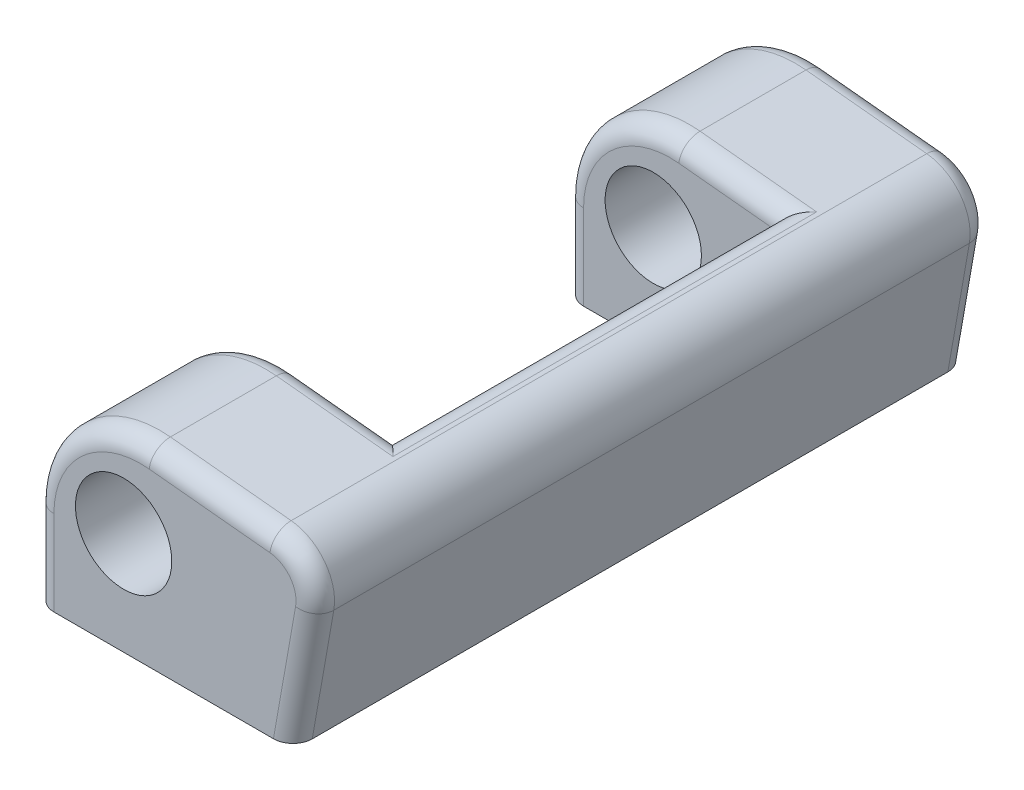
ISO-10303-21;
HEADER;
FILE_DESCRIPTION(('STEP AP214'),'2;1');
FILE_NAME('part.step','',(''),(''),'','','');
FILE_SCHEMA(('AUTOMOTIVE_DESIGN { 1 0 10303 214 1 1 1 1 }'));
ENDSEC;
DATA;
#1=APPLICATION_CONTEXT('core data for automotive mechanical design processes');
#2=APPLICATION_PROTOCOL_DEFINITION('international standard','automotive_design',2000,#1);
#3=PRODUCT_CONTEXT('',#1,'mechanical');
#4=PRODUCT('Part','Part','',(#3));
#5=PRODUCT_RELATED_PRODUCT_CATEGORY('part','',(#4));
#6=PRODUCT_DEFINITION_FORMATION('','',#4);
#7=PRODUCT_DEFINITION_CONTEXT('part definition',#1,'design');
#8=PRODUCT_DEFINITION('design','',#6,#7);
#9=PRODUCT_DEFINITION_SHAPE('','',#8);
#10=(LENGTH_UNIT() NAMED_UNIT(*) SI_UNIT(.MILLI.,.METRE.));
#11=(NAMED_UNIT(*) PLANE_ANGLE_UNIT() SI_UNIT($,.RADIAN.));
#12=(NAMED_UNIT(*) SI_UNIT($,.STERADIAN.) SOLID_ANGLE_UNIT());
#13=UNCERTAINTY_MEASURE_WITH_UNIT(LENGTH_MEASURE(1.E-05),#10,'distance_accuracy_value','');
#14=(GEOMETRIC_REPRESENTATION_CONTEXT(3) GLOBAL_UNCERTAINTY_ASSIGNED_CONTEXT((#13)) GLOBAL_UNIT_ASSIGNED_CONTEXT((#10,
#11,#12)) REPRESENTATION_CONTEXT('',''));
#15=CARTESIAN_POINT('',(0.,0.,0.));
#16=DIRECTION('',(0.,0.,1.));
#17=DIRECTION('',(1.,0.,0.));
#18=AXIS2_PLACEMENT_3D('',#15,#16,#17);
#19=CARTESIAN_POINT('',(11.,8.84513681676702,35.));
#20=DIRECTION('',(0.,0.,-1.));
#21=DIRECTION('',(-1.,0.,0.));
#22=AXIS2_PLACEMENT_3D('',#19,#20,#21);
#23=PLANE('',#22);
#24=CARTESIAN_POINT('',(9.2353705857211,10.6634765345084,35.));
#25=DIRECTION('',(0.,0.,1.));
#26=DIRECTION('',(1.,0.,0.));
#27=AXIS2_PLACEMENT_3D('',#24,#25,#26);
#28=CIRCLE('',#27,5.);
#29=CARTESIAN_POINT('',(14.2353705857211,10.6634765345084,35.));
#30=VERTEX_POINT('',#29);
#31=EDGE_CURVE('E370',#30,#30,#28,.T.);
#32=ORIENTED_EDGE('',*,*,#31,.F.);
#33=EDGE_LOOP('',(#32));
#34=FACE_BOUND('',#33,.T.);
#35=CARTESIAN_POINT('',(24.1401596242759,13.561046227012,35.));
#36=DIRECTION('',(0.,0.,-1.));
#37=DIRECTION('',(-1.,0.,0.));
#38=AXIS2_PLACEMENT_3D('',#35,#36,#37);
#39=CIRCLE('',#38,3.);
#40=CARTESIAN_POINT('',(24.4386707813389,16.5461577976419,35.));
#41=VERTEX_POINT('',#40);
#42=CARTESIAN_POINT('',(27.0945828833125,13.0401016940112,35.));
#43=VERTEX_POINT('',#42);
#44=EDGE_CURVE('E359',#41,#43,#39,.T.);
#45=ORIENTED_EDGE('',*,*,#44,.F.);
#46=DIRECTION('',(-0.995037190209989,0.0995037190209988,0.));
#47=VECTOR('',#46,1.);
#48=CARTESIAN_POINT('',(11.895533471189,17.8004715286569,35.));
#49=LINE('',#48,#47);
#50=CARTESIAN_POINT('',(11.8955334711891,17.8004715286569,35.));
#51=VERTEX_POINT('',#50);
#52=EDGE_CURVE('E290',#41,#51,#49,.T.);
#53=ORIENTED_EDGE('',*,*,#52,.T.);
#54=CARTESIAN_POINT('',(11.,8.84513681676702,35.));
#55=DIRECTION('',(0.,0.,-1.));
#56=DIRECTION('',(-1.,0.,0.));
#57=AXIS2_PLACEMENT_3D('',#54,#55,#56);
#58=CIRCLE('',#57,9.);
#59=CARTESIAN_POINT('',(2.,8.84513681676694,35.));
#60=VERTEX_POINT('',#59);
#61=EDGE_CURVE('E292',#51,#60,#58,.F.);
#62=ORIENTED_EDGE('',*,*,#61,.T.);
#63=DIRECTION('',(0.,-1.,0.));
#64=VECTOR('',#63,1.);
#65=CARTESIAN_POINT('',(2.,8.84513681676702,35.));
#66=LINE('',#65,#64);
#67=CARTESIAN_POINT('',(2.00000000000001,0.,35.));
#68=VERTEX_POINT('',#67);
#69=EDGE_CURVE('E294',#60,#68,#66,.T.);
#70=ORIENTED_EDGE('',*,*,#69,.T.);
#71=DIRECTION('',(1.,0.,0.));
#72=VECTOR('',#71,1.);
#73=CARTESIAN_POINT('',(26.8261143472477,0.,35.));
#74=LINE('',#73,#72);
#75=CARTESIAN_POINT('',(24.7952611234762,0.,35.));
#76=VERTEX_POINT('',#75);
#77=EDGE_CURVE('E226',#68,#76,#74,.T.);
#78=ORIENTED_EDGE('',*,*,#77,.T.);
#79=DIRECTION('',(0.173648177666926,0.984807753012209,0.));
#80=VECTOR('',#79,1.);
#81=CARTESIAN_POINT('',(25.8918905824137,6.21929471332926,35.));
#82=LINE('',#81,#80);
#83=EDGE_CURVE('E287',#76,#43,#82,.T.);
#84=ORIENTED_EDGE('',*,*,#83,.T.);
#85=EDGE_LOOP('',(#45,#53,#62,#70,#78,#84));
#86=FACE_BOUND('',#85,.T.);
#87=ADVANCED_FACE('F35',(#34,#86),#23,.F.);
#88=CARTESIAN_POINT('',(11.,8.84513681676702,-35.));
#89=DIRECTION('',(0.,0.,-1.));
#90=DIRECTION('',(-1.,0.,0.));
#91=AXIS2_PLACEMENT_3D('',#88,#89,#90);
#92=PLANE('',#91);
#93=CARTESIAN_POINT('',(9.2353705857211,10.6634765345084,-35.));
#94=DIRECTION('',(0.,0.,1.));
#95=DIRECTION('',(1.,0.,0.));
#96=AXIS2_PLACEMENT_3D('',#93,#94,#95);
#97=CIRCLE('',#96,5.);
#98=CARTESIAN_POINT('',(14.2353705857211,10.6634765345084,-35.));
#99=VERTEX_POINT('',#98);
#100=EDGE_CURVE('E352',#99,#99,#97,.T.);
#101=ORIENTED_EDGE('',*,*,#100,.T.);
#102=EDGE_LOOP('',(#101));
#103=FACE_BOUND('',#102,.T.);
#104=CARTESIAN_POINT('',(24.1401596242759,13.561046227012,-35.));
#105=DIRECTION('',(0.,0.,-1.));
#106=DIRECTION('',(-1.,0.,0.));
#107=AXIS2_PLACEMENT_3D('',#104,#105,#106);
#108=CIRCLE('',#107,3.);
#109=CARTESIAN_POINT('',(27.0945828833125,13.0401016940112,-35.));
#110=VERTEX_POINT('',#109);
#111=CARTESIAN_POINT('',(24.4386707813389,16.5461577976419,-35.));
#112=VERTEX_POINT('',#111);
#113=EDGE_CURVE('E323',#110,#112,#108,.F.);
#114=ORIENTED_EDGE('',*,*,#113,.F.);
#115=DIRECTION('',(0.173648177666926,0.984807753012209,0.));
#116=VECTOR('',#115,1.);
#117=CARTESIAN_POINT('',(24.8564988412233,0.347296355333853,-35.));
#118=LINE('',#117,#116);
#119=CARTESIAN_POINT('',(24.7952611234762,0.,-35.));
#120=VERTEX_POINT('',#119);
#121=EDGE_CURVE('E256',#110,#120,#118,.F.);
#122=ORIENTED_EDGE('',*,*,#121,.T.);
#123=DIRECTION('',(1.,0.,0.));
#124=VECTOR('',#123,1.);
#125=CARTESIAN_POINT('',(26.8261143472477,0.,-35.));
#126=LINE('',#125,#124);
#127=CARTESIAN_POINT('',(2.00000000000001,0.,-35.));
#128=VERTEX_POINT('',#127);
#129=EDGE_CURVE('E199',#128,#120,#126,.T.);
#130=ORIENTED_EDGE('',*,*,#129,.F.);
#131=DIRECTION('',(0.,-1.,0.));
#132=VECTOR('',#131,1.);
#133=CARTESIAN_POINT('',(2.,8.84513681676694,-35.));
#134=LINE('',#133,#132);
#135=CARTESIAN_POINT('',(2.,8.84513681676694,-35.));
#136=VERTEX_POINT('',#135);
#137=EDGE_CURVE('E263',#128,#136,#134,.F.);
#138=ORIENTED_EDGE('',*,*,#137,.T.);
#139=CARTESIAN_POINT('',(11.,8.84513681676702,-35.));
#140=DIRECTION('',(0.,0.,-1.));
#141=DIRECTION('',(-1.,0.,0.));
#142=AXIS2_PLACEMENT_3D('',#139,#140,#141);
#143=CIRCLE('',#142,9.);
#144=CARTESIAN_POINT('',(11.8955334711891,17.8004715286569,-35.));
#145=VERTEX_POINT('',#144);
#146=EDGE_CURVE('E261',#136,#145,#143,.T.);
#147=ORIENTED_EDGE('',*,*,#146,.T.);
#148=DIRECTION('',(-0.995037190209989,0.0995037190209988,0.));
#149=VECTOR('',#148,1.);
#150=CARTESIAN_POINT('',(29.800992561958,16.00992561958,-35.));
#151=LINE('',#150,#149);
#152=EDGE_CURVE('E258',#145,#112,#151,.F.);
#153=ORIENTED_EDGE('',*,*,#152,.T.);
#154=EDGE_LOOP('',(#114,#122,#130,#138,#147,#153));
#155=FACE_BOUND('',#154,.T.);
#156=ADVANCED_FACE('F382',(#103,#155),#92,.T.);
#157=CARTESIAN_POINT('',(26.8261143472477,0.,35.));
#158=DIRECTION('',(0.,1.,0.));
#159=DIRECTION('',(-1.,0.,0.));
#160=AXIS2_PLACEMENT_3D('',#157,#158,#159);
#161=PLANE('',#160);
#162=DIRECTION('',(0.,0.,-1.));
#163=VECTOR('',#162,1.);
#164=CARTESIAN_POINT('',(0.,0.,35.));
#165=LINE('',#164,#163);
#166=CARTESIAN_POINT('',(0.,0.,-22.));
#167=VERTEX_POINT('',#166);
#168=CARTESIAN_POINT('',(0.,0.,-33.));
#169=VERTEX_POINT('',#168);
#170=EDGE_CURVE('E229',#167,#169,#165,.T.);
#171=ORIENTED_EDGE('',*,*,#170,.T.);
#172=CARTESIAN_POINT('',(2.,0.,-33.));
#173=DIRECTION('',(0.,1.,0.));
#174=DIRECTION('',(-1.,0.,0.));
#175=AXIS2_PLACEMENT_3D('',#172,#173,#174);
#176=CIRCLE('',#175,2.);
#177=EDGE_CURVE('E279',#169,#128,#176,.F.);
#178=ORIENTED_EDGE('',*,*,#177,.T.);
#179=ORIENTED_EDGE('',*,*,#129,.T.);
#180=CARTESIAN_POINT('',(24.7952611234762,0.,-33.));
#181=DIRECTION('',(0.,1.,0.));
#182=DIRECTION('',(-1.,0.,0.));
#183=AXIS2_PLACEMENT_3D('',#180,#181,#182);
#184=ELLIPSE('',#183,2.03085322377149,2.);
#185=CARTESIAN_POINT('',(26.8261143472477,0.,-33.));
#186=VERTEX_POINT('',#185);
#187=EDGE_CURVE('E271',#120,#186,#184,.F.);
#188=ORIENTED_EDGE('',*,*,#187,.T.);
#189=DIRECTION('',(0.,0.,-1.));
#190=VECTOR('',#189,1.);
#191=CARTESIAN_POINT('',(26.8261143472477,0.,35.));
#192=LINE('',#191,#190);
#193=CARTESIAN_POINT('',(26.8261143472477,0.,33.));
#194=VERTEX_POINT('',#193);
#195=EDGE_CURVE('E243',#194,#186,#192,.T.);
#196=ORIENTED_EDGE('',*,*,#195,.F.);
#197=CARTESIAN_POINT('',(24.7952611234762,0.,33.));
#198=DIRECTION('',(0.,1.,0.));
#199=DIRECTION('',(1.,0.,0.));
#200=AXIS2_PLACEMENT_3D('',#197,#198,#199);
#201=ELLIPSE('',#200,2.03085322377149,2.);
#202=EDGE_CURVE('E269',#194,#76,#201,.F.);
#203=ORIENTED_EDGE('',*,*,#202,.T.);
#204=ORIENTED_EDGE('',*,*,#77,.F.);
#205=CARTESIAN_POINT('',(2.,0.,33.));
#206=DIRECTION('',(0.,1.,0.));
#207=DIRECTION('',(-1.,0.,0.));
#208=AXIS2_PLACEMENT_3D('',#205,#206,#207);
#209=CIRCLE('',#208,2.);
#210=CARTESIAN_POINT('',(0.,0.,33.));
#211=VERTEX_POINT('',#210);
#212=EDGE_CURVE('E275',#68,#211,#209,.F.);
#213=ORIENTED_EDGE('',*,*,#212,.T.);
#214=CARTESIAN_POINT('',(0.,0.,22.));
#215=VERTEX_POINT('',#214);
#216=EDGE_CURVE('E232',#211,#215,#165,.T.);
#217=ORIENTED_EDGE('',*,*,#216,.T.);
#218=CARTESIAN_POINT('',(2.,0.,22.));
#219=DIRECTION('',(0.,1.,0.));
#220=DIRECTION('',(-1.,0.,0.));
#221=AXIS2_PLACEMENT_3D('',#218,#219,#220);
#222=CIRCLE('',#221,2.);
#223=CARTESIAN_POINT('',(2.,0.,20.));
#224=VERTEX_POINT('',#223);
#225=EDGE_CURVE('E273',#215,#224,#222,.F.);
#226=ORIENTED_EDGE('',*,*,#225,.T.);
#227=DIRECTION('',(1.,0.,0.));
#228=VECTOR('',#227,1.);
#229=CARTESIAN_POINT('',(-22.,0.,20.));
#230=LINE('',#229,#228);
#231=CARTESIAN_POINT('',(22.,0.,20.));
#232=VERTEX_POINT('',#231);
#233=EDGE_CURVE('E209',#224,#232,#230,.T.);
#234=ORIENTED_EDGE('',*,*,#233,.T.);
#235=DIRECTION('',(0.,0.,-1.));
#236=VECTOR('',#235,1.);
#237=CARTESIAN_POINT('',(22.,0.,-20.));
#238=LINE('',#237,#236);
#239=CARTESIAN_POINT('',(22.,0.,-20.));
#240=VERTEX_POINT('',#239);
#241=EDGE_CURVE('E193',#232,#240,#238,.T.);
#242=ORIENTED_EDGE('',*,*,#241,.T.);
#243=DIRECTION('',(-1.,0.,0.));
#244=VECTOR('',#243,1.);
#245=CARTESIAN_POINT('',(-22.,0.,-20.));
#246=LINE('',#245,#244);
#247=CARTESIAN_POINT('',(2.,0.,-20.));
#248=VERTEX_POINT('',#247);
#249=EDGE_CURVE('E203',#240,#248,#246,.T.);
#250=ORIENTED_EDGE('',*,*,#249,.T.);
#251=CARTESIAN_POINT('',(2.,0.,-22.));
#252=DIRECTION('',(0.,1.,0.));
#253=DIRECTION('',(-1.,0.,0.));
#254=AXIS2_PLACEMENT_3D('',#251,#252,#253);
#255=CIRCLE('',#254,2.);
#256=EDGE_CURVE('E277',#248,#167,#255,.F.);
#257=ORIENTED_EDGE('',*,*,#256,.T.);
#258=EDGE_LOOP('',(#171,#178,#179,#188,#196,#203,#204,#213,#217,#226,#234,#242,#250,#257));
#259=FACE_BOUND('',#258,.T.);
#260=ADVANCED_FACE('F213',(#259),#161,.F.);
#261=CARTESIAN_POINT('',(12.0945409092311,19.7905459090769,35.));
#262=DIRECTION('',(-0.0995037190209988,-0.995037190209989,0.));
#263=DIRECTION('',(0.995037190209989,-0.0995037190209988,0.));
#264=AXIS2_PLACEMENT_3D('',#261,#262,#263);
#265=PLANE('',#264);
#266=DIRECTION('',(-0.995037190209989,0.0995037190209988,0.));
#267=VECTOR('',#266,1.);
#268=CARTESIAN_POINT('',(12.0945409092311,19.7905459090769,33.));
#269=LINE('',#268,#267);
#270=CARTESIAN_POINT('',(12.0945409092311,19.7905459090769,33.));
#271=VERTEX_POINT('',#270);
#272=CARTESIAN_POINT('',(24.6376782193809,18.5362321780619,33.));
#273=VERTEX_POINT('',#272);
#274=EDGE_CURVE('E252',#271,#273,#269,.F.);
#275=ORIENTED_EDGE('',*,*,#274,.T.);
#276=DIRECTION('',(0.,0.,-1.));
#277=VECTOR('',#276,1.);
#278=CARTESIAN_POINT('',(24.6376782193809,18.5362321780619,35.));
#279=LINE('',#278,#277);
#280=CARTESIAN_POINT('',(24.6376782193809,18.5362321780619,-33.));
#281=VERTEX_POINT('',#280);
#282=EDGE_CURVE('E44',#273,#281,#279,.T.);
#283=ORIENTED_EDGE('',*,*,#282,.T.);
#284=DIRECTION('',(-0.995037190209989,0.0995037190209988,0.));
#285=VECTOR('',#284,1.);
#286=CARTESIAN_POINT('',(12.0945409092311,19.7905459090769,-33.));
#287=LINE('',#286,#285);
#288=CARTESIAN_POINT('',(12.0945409092311,19.7905459090769,-33.));
#289=VERTEX_POINT('',#288);
#290=EDGE_CURVE('E254',#281,#289,#287,.T.);
#291=ORIENTED_EDGE('',*,*,#290,.T.);
#292=DIRECTION('',(0.,0.,-1.));
#293=VECTOR('',#292,1.);
#294=CARTESIAN_POINT('',(12.0945409092311,19.7905459090769,35.));
#295=LINE('',#294,#293);
#296=CARTESIAN_POINT('',(12.0945409092311,19.7905459090769,-22.));
#297=VERTEX_POINT('',#296);
#298=EDGE_CURVE('E239',#297,#289,#295,.T.);
#299=ORIENTED_EDGE('',*,*,#298,.F.);
#300=DIRECTION('',(-0.995037190209989,0.0995037190209988,0.));
#301=VECTOR('',#300,1.);
#302=CARTESIAN_POINT('',(22.,18.8,-22.));
#303=LINE('',#302,#301);
#304=CARTESIAN_POINT('',(24.199007438042,18.5800992561958,-22.));
#305=VERTEX_POINT('',#304);
#306=EDGE_CURVE('E250',#297,#305,#303,.F.);
#307=ORIENTED_EDGE('',*,*,#306,.T.);
#308=DIRECTION('',(0.,0.,-1.));
#309=VECTOR('',#308,1.);
#310=CARTESIAN_POINT('',(24.199007438042,18.5800992561958,20.));
#311=LINE('',#310,#309);
#312=CARTESIAN_POINT('',(24.199007438042,18.5800992561958,22.));
#313=VERTEX_POINT('',#312);
#314=EDGE_CURVE('E246',#305,#313,#311,.F.);
#315=ORIENTED_EDGE('',*,*,#314,.T.);
#316=DIRECTION('',(0.995037190209989,-0.0995037190209988,0.));
#317=VECTOR('',#316,1.);
#318=CARTESIAN_POINT('',(12.0945409092311,19.7905459090769,22.));
#319=LINE('',#318,#317);
#320=CARTESIAN_POINT('',(12.0945409092311,19.7905459090769,22.));
#321=VERTEX_POINT('',#320);
#322=EDGE_CURVE('E248',#313,#321,#319,.F.);
#323=ORIENTED_EDGE('',*,*,#322,.T.);
#324=EDGE_CURVE('E242',#271,#321,#295,.T.);
#325=ORIENTED_EDGE('',*,*,#324,.F.);
#326=EDGE_LOOP('',(#275,#283,#291,#299,#307,#315,#323,#325));
#327=FACE_BOUND('',#326,.T.);
#328=ADVANCED_FACE('F420',(#327),#265,.F.);
#329=CARTESIAN_POINT('',(11.,8.84513681676702,35.));
#330=DIRECTION('',(0.,0.,-1.));
#331=DIRECTION('',(-1.,0.,0.));
#332=AXIS2_PLACEMENT_3D('',#329,#330,#331);
#333=CYLINDRICAL_SURFACE('',#332,11.);
#334=ORIENTED_EDGE('',*,*,#298,.T.);
#335=CARTESIAN_POINT('',(11.,8.84513681676702,-33.));
#336=DIRECTION('',(0.,0.,-1.));
#337=DIRECTION('',(-1.,0.,0.));
#338=AXIS2_PLACEMENT_3D('',#335,#336,#337);
#339=CIRCLE('',#338,11.);
#340=CARTESIAN_POINT('',(0.,8.84513681676694,-33.));
#341=VERTEX_POINT('',#340);
#342=EDGE_CURVE('E308',#289,#341,#339,.F.);
#343=ORIENTED_EDGE('',*,*,#342,.T.);
#344=DIRECTION('',(0.,0.,-1.));
#345=VECTOR('',#344,1.);
#346=CARTESIAN_POINT('',(0.,8.84513681676694,35.));
#347=LINE('',#346,#345);
#348=CARTESIAN_POINT('',(0.,8.84513681676694,-22.));
#349=VERTEX_POINT('',#348);
#350=EDGE_CURVE('E235',#349,#341,#347,.T.);
#351=ORIENTED_EDGE('',*,*,#350,.F.);
#352=CARTESIAN_POINT('',(11.,8.84513681676702,-22.));
#353=DIRECTION('',(0.,0.,1.));
#354=DIRECTION('',(1.,0.,0.));
#355=AXIS2_PLACEMENT_3D('',#352,#353,#354);
#356=CIRCLE('',#355,11.);
#357=EDGE_CURVE('E306',#349,#297,#356,.F.);
#358=ORIENTED_EDGE('',*,*,#357,.T.);
#359=EDGE_LOOP('',(#334,#343,#351,#358));
#360=FACE_BOUND('',#359,.T.);
#361=ADVANCED_FACE('F417',(#360),#333,.T.);
#362=CARTESIAN_POINT('',(0.,8.84513681676694,33.));
#363=VERTEX_POINT('',#362);
#364=CARTESIAN_POINT('',(0.,8.84513681676694,22.));
#365=VERTEX_POINT('',#364);
#366=EDGE_CURVE('E236',#363,#365,#347,.T.);
#367=ORIENTED_EDGE('',*,*,#366,.F.);
#368=CARTESIAN_POINT('',(11.,8.84513681676702,33.));
#369=DIRECTION('',(0.,0.,-1.));
#370=DIRECTION('',(-1.,0.,0.));
#371=AXIS2_PLACEMENT_3D('',#368,#369,#370);
#372=CIRCLE('',#371,11.);
#373=EDGE_CURVE('E312',#363,#271,#372,.T.);
#374=ORIENTED_EDGE('',*,*,#373,.T.);
#375=ORIENTED_EDGE('',*,*,#324,.T.);
#376=CARTESIAN_POINT('',(11.,8.84513681676702,22.));
#377=DIRECTION('',(0.,0.,-1.));
#378=DIRECTION('',(-1.,0.,0.));
#379=AXIS2_PLACEMENT_3D('',#376,#377,#378);
#380=CIRCLE('',#379,11.);
#381=EDGE_CURVE('E310',#321,#365,#380,.F.);
#382=ORIENTED_EDGE('',*,*,#381,.T.);
#383=EDGE_LOOP('',(#367,#374,#375,#382));
#384=FACE_BOUND('',#383,.T.);
#385=ADVANCED_FACE('F415',(#384),#333,.T.);
#386=CARTESIAN_POINT('',(0.,0.,35.));
#387=DIRECTION('',(1.,0.,0.));
#388=DIRECTION('',(0.,0.,-1.));
#389=AXIS2_PLACEMENT_3D('',#386,#387,#388);
#390=PLANE('',#389);
#391=ORIENTED_EDGE('',*,*,#350,.T.);
#392=DIRECTION('',(0.,-1.,0.));
#393=VECTOR('',#392,1.);
#394=CARTESIAN_POINT('',(0.,0.,-33.));
#395=LINE('',#394,#393);
#396=EDGE_CURVE('E267',#341,#169,#395,.T.);
#397=ORIENTED_EDGE('',*,*,#396,.T.);
#398=ORIENTED_EDGE('',*,*,#170,.F.);
#399=DIRECTION('',(0.,-1.,0.));
#400=VECTOR('',#399,1.);
#401=CARTESIAN_POINT('',(0.,8.84513681676694,-22.));
#402=LINE('',#401,#400);
#403=EDGE_CURVE('E265',#167,#349,#402,.F.);
#404=ORIENTED_EDGE('',*,*,#403,.T.);
#405=EDGE_LOOP('',(#391,#397,#398,#404));
#406=FACE_BOUND('',#405,.T.);
#407=ADVANCED_FACE('F411',(#406),#390,.F.);
#408=ORIENTED_EDGE('',*,*,#216,.F.);
#409=DIRECTION('',(0.,-1.,0.));
#410=VECTOR('',#409,1.);
#411=CARTESIAN_POINT('',(0.,0.,33.));
#412=LINE('',#411,#410);
#413=EDGE_CURVE('E298',#211,#363,#412,.F.);
#414=ORIENTED_EDGE('',*,*,#413,.T.);
#415=ORIENTED_EDGE('',*,*,#366,.T.);
#416=DIRECTION('',(0.,1.,0.));
#417=VECTOR('',#416,1.);
#418=CARTESIAN_POINT('',(0.,0.,22.));
#419=LINE('',#418,#417);
#420=EDGE_CURVE('E296',#365,#215,#419,.F.);
#421=ORIENTED_EDGE('',*,*,#420,.T.);
#422=EDGE_LOOP('',(#408,#414,#415,#421));
#423=FACE_BOUND('',#422,.T.);
#424=ADVANCED_FACE('F414',(#423),#390,.F.);
#425=CARTESIAN_POINT('',(30.,18.,35.));
#426=DIRECTION('',(-0.984807753012209,0.173648177666926,0.));
#427=DIRECTION('',(-0.173648177666926,-0.984807753012209,0.));
#428=AXIS2_PLACEMENT_3D('',#425,#426,#427);
#429=PLANE('',#428);
#430=DIRECTION('',(0.173648177666926,0.984807753012209,0.));
#431=VECTOR('',#430,1.);
#432=CARTESIAN_POINT('',(30.,18.,-33.));
#433=LINE('',#432,#431);
#434=CARTESIAN_POINT('',(29.0641983893369,12.6928053386773,-33.));
#435=VERTEX_POINT('',#434);
#436=EDGE_CURVE('E317',#186,#435,#433,.T.);
#437=ORIENTED_EDGE('',*,*,#436,.T.);
#438=DIRECTION('',(0.,0.,-1.));
#439=VECTOR('',#438,1.);
#440=CARTESIAN_POINT('',(29.0641983893369,12.6928053386773,35.));
#441=LINE('',#440,#439);
#442=CARTESIAN_POINT('',(29.0641983893369,12.6928053386773,33.));
#443=VERTEX_POINT('',#442);
#444=EDGE_CURVE('E11',#435,#443,#441,.F.);
#445=ORIENTED_EDGE('',*,*,#444,.T.);
#446=DIRECTION('',(0.173648177666926,0.984807753012209,0.));
#447=VECTOR('',#446,1.);
#448=CARTESIAN_POINT('',(30.,18.,33.));
#449=LINE('',#448,#447);
#450=EDGE_CURVE('E315',#443,#194,#449,.F.);
#451=ORIENTED_EDGE('',*,*,#450,.T.);
#452=ORIENTED_EDGE('',*,*,#195,.T.);
#453=EDGE_LOOP('',(#437,#445,#451,#452));
#454=FACE_BOUND('',#453,.T.);
#455=ADVANCED_FACE('F425',(#454),#429,.F.);
#456=CARTESIAN_POINT('',(22.,19.845136816767,-20.));
#457=DIRECTION('',(-1.,0.,0.));
#458=DIRECTION('',(0.,0.,1.));
#459=AXIS2_PLACEMENT_3D('',#456,#457,#458);
#460=PLANE('',#459);
#461=DIRECTION('',(0.,-1.,0.));
#462=VECTOR('',#461,1.);
#463=CARTESIAN_POINT('',(22.,19.845136816767,20.));
#464=LINE('',#463,#462);
#465=CARTESIAN_POINT('',(22.,16.5900248757758,20.));
#466=VERTEX_POINT('',#465);
#467=EDGE_CURVE('E200',#466,#232,#464,.T.);
#468=ORIENTED_EDGE('',*,*,#467,.F.);
#469=DIRECTION('',(0.,0.,-1.));
#470=VECTOR('',#469,1.);
#471=CARTESIAN_POINT('',(22.,16.5900248757758,-20.));
#472=LINE('',#471,#470);
#473=CARTESIAN_POINT('',(22.,16.5900248757758,-20.));
#474=VERTEX_POINT('',#473);
#475=EDGE_CURVE('E195',#466,#474,#472,.T.);
#476=ORIENTED_EDGE('',*,*,#475,.T.);
#477=DIRECTION('',(0.,-1.,0.));
#478=VECTOR('',#477,1.);
#479=CARTESIAN_POINT('',(22.,19.845136816767,-20.));
#480=LINE('',#479,#478);
#481=EDGE_CURVE('E188',#474,#240,#480,.T.);
#482=ORIENTED_EDGE('',*,*,#481,.T.);
#483=ORIENTED_EDGE('',*,*,#241,.F.);
#484=EDGE_LOOP('',(#468,#476,#482,#483));
#485=FACE_BOUND('',#484,.T.);
#486=ADVANCED_FACE('F191',(#485),#460,.T.);
#487=CARTESIAN_POINT('',(-22.,19.845136816767,-20.));
#488=DIRECTION('',(0.,0.,1.));
#489=DIRECTION('',(1.,0.,0.));
#490=AXIS2_PLACEMENT_3D('',#487,#488,#489);
#491=PLANE('',#490);
#492=CARTESIAN_POINT('',(9.2353705857211,10.6634765345084,-20.));
#493=DIRECTION('',(0.,0.,1.));
#494=DIRECTION('',(1.,0.,0.));
#495=AXIS2_PLACEMENT_3D('',#492,#493,#494);
#496=CIRCLE('',#495,5.);
#497=CARTESIAN_POINT('',(14.2353705857211,10.6634765345084,-20.));
#498=VERTEX_POINT('',#497);
#499=EDGE_CURVE('E221',#498,#498,#496,.T.);
#500=ORIENTED_EDGE('',*,*,#499,.F.);
#501=EDGE_LOOP('',(#500));
#502=FACE_BOUND('',#501,.T.);
#503=ORIENTED_EDGE('',*,*,#481,.F.);
#504=CARTESIAN_POINT('',(24.,16.5900248757758,-20.));
#505=DIRECTION('',(0.,0.,1.));
#506=DIRECTION('',(1.,0.,0.));
#507=AXIS2_PLACEMENT_3D('',#504,#505,#506);
#508=CIRCLE('',#507,2.);
#509=CARTESIAN_POINT('',(22.00992561958,16.7890323138178,-20.));
#510=VERTEX_POINT('',#509);
#511=EDGE_CURVE('E319',#474,#510,#508,.F.);
#512=ORIENTED_EDGE('',*,*,#511,.T.);
#513=DIRECTION('',(-0.995037190209989,0.0995037190209988,0.));
#514=VECTOR('',#513,1.);
#515=CARTESIAN_POINT('',(11.8955334711891,17.8004715286569,-20.));
#516=LINE('',#515,#514);
#517=CARTESIAN_POINT('',(11.8955334711891,17.8004715286569,-20.));
#518=VERTEX_POINT('',#517);
#519=EDGE_CURVE('E284',#510,#518,#516,.T.);
#520=ORIENTED_EDGE('',*,*,#519,.T.);
#521=CARTESIAN_POINT('',(11.,8.84513681676702,-20.));
#522=DIRECTION('',(0.,0.,1.));
#523=DIRECTION('',(1.,0.,0.));
#524=AXIS2_PLACEMENT_3D('',#521,#522,#523);
#525=CIRCLE('',#524,9.);
#526=CARTESIAN_POINT('',(2.,8.84513681676694,-20.));
#527=VERTEX_POINT('',#526);
#528=EDGE_CURVE('E281',#518,#527,#525,.T.);
#529=ORIENTED_EDGE('',*,*,#528,.T.);
#530=DIRECTION('',(0.,-1.,0.));
#531=VECTOR('',#530,1.);
#532=CARTESIAN_POINT('',(2.,0.,-20.));
#533=LINE('',#532,#531);
#534=EDGE_CURVE('E206',#527,#248,#533,.T.);
#535=ORIENTED_EDGE('',*,*,#534,.T.);
#536=ORIENTED_EDGE('',*,*,#249,.F.);
#537=EDGE_LOOP('',(#503,#512,#520,#529,#535,#536));
#538=FACE_BOUND('',#537,.T.);
#539=ADVANCED_FACE('F204',(#502,#538),#491,.T.);
#540=CARTESIAN_POINT('',(-22.,19.845136816767,20.));
#541=DIRECTION('',(0.,0.,-1.));
#542=DIRECTION('',(-1.,0.,0.));
#543=AXIS2_PLACEMENT_3D('',#540,#541,#542);
#544=PLANE('',#543);
#545=CARTESIAN_POINT('',(9.2353705857211,10.6634765345084,20.));
#546=DIRECTION('',(0.,0.,-1.));
#547=DIRECTION('',(-1.,0.,0.));
#548=AXIS2_PLACEMENT_3D('',#545,#546,#547);
#549=CIRCLE('',#548,5.);
#550=CARTESIAN_POINT('',(4.2353705857211,10.6634765345084,20.));
#551=VERTEX_POINT('',#550);
#552=EDGE_CURVE('E349',#551,#551,#549,.T.);
#553=ORIENTED_EDGE('',*,*,#552,.F.);
#554=EDGE_LOOP('',(#553));
#555=FACE_BOUND('',#554,.T.);
#556=ORIENTED_EDGE('',*,*,#233,.F.);
#557=DIRECTION('',(0.,1.,0.));
#558=VECTOR('',#557,1.);
#559=CARTESIAN_POINT('',(2.,8.84513681676694,20.));
#560=LINE('',#559,#558);
#561=CARTESIAN_POINT('',(2.,8.84513681676694,20.));
#562=VERTEX_POINT('',#561);
#563=EDGE_CURVE('E304',#224,#562,#560,.T.);
#564=ORIENTED_EDGE('',*,*,#563,.T.);
#565=CARTESIAN_POINT('',(11.,8.84513681676702,20.));
#566=DIRECTION('',(0.,0.,-1.));
#567=DIRECTION('',(-1.,0.,0.));
#568=AXIS2_PLACEMENT_3D('',#565,#566,#567);
#569=CIRCLE('',#568,9.);
#570=CARTESIAN_POINT('',(11.8955334711891,17.8004715286569,20.));
#571=VERTEX_POINT('',#570);
#572=EDGE_CURVE('E300',#562,#571,#569,.T.);
#573=ORIENTED_EDGE('',*,*,#572,.T.);
#574=DIRECTION('',(0.995037190209989,-0.0995037190209988,0.));
#575=VECTOR('',#574,1.);
#576=CARTESIAN_POINT('',(21.800992561958,16.80992561958,20.));
#577=LINE('',#576,#575);
#578=CARTESIAN_POINT('',(22.00992561958,16.7890323138178,20.));
#579=VERTEX_POINT('',#578);
#580=EDGE_CURVE('E302',#571,#579,#577,.T.);
#581=ORIENTED_EDGE('',*,*,#580,.T.);
#582=CARTESIAN_POINT('',(24.,16.5900248757758,20.));
#583=DIRECTION('',(0.,0.,-1.));
#584=DIRECTION('',(-1.,0.,0.));
#585=AXIS2_PLACEMENT_3D('',#582,#583,#584);
#586=CIRCLE('',#585,2.);
#587=EDGE_CURVE('E321',#579,#466,#586,.F.);
#588=ORIENTED_EDGE('',*,*,#587,.T.);
#589=ORIENTED_EDGE('',*,*,#467,.T.);
#590=EDGE_LOOP('',(#556,#564,#573,#581,#588,#589));
#591=FACE_BOUND('',#590,.T.);
#592=ADVANCED_FACE('F446',(#555,#591),#544,.T.);
#593=CARTESIAN_POINT('',(2.,0.,-33.));
#594=DIRECTION('',(0.,1.,0.));
#595=DIRECTION('',(0.,0.,1.));
#596=AXIS2_PLACEMENT_3D('',#593,#594,#595);
#597=CYLINDRICAL_SURFACE('',#596,2.);
#598=ORIENTED_EDGE('',*,*,#177,.F.);
#599=ORIENTED_EDGE('',*,*,#396,.F.);
#600=CARTESIAN_POINT('',(2.,8.84513681676694,-33.));
#601=DIRECTION('',(0.,1.,0.));
#602=DIRECTION('',(0.,0.,1.));
#603=AXIS2_PLACEMENT_3D('',#600,#601,#602);
#604=CIRCLE('',#603,2.);
#605=EDGE_CURVE('E215',#136,#341,#604,.T.);
#606=ORIENTED_EDGE('',*,*,#605,.F.);
#607=ORIENTED_EDGE('',*,*,#137,.F.);
#608=EDGE_LOOP('',(#598,#599,#606,#607));
#609=FACE_BOUND('',#608,.T.);
#610=ADVANCED_FACE('F443',(#609),#597,.T.);
#611=CARTESIAN_POINT('',(28.0303844939756,18.3472963553339,-33.));
#612=DIRECTION('',(-0.173648177666926,-0.984807753012209,0.));
#613=DIRECTION('',(0.984807753012209,-0.173648177666926,0.));
#614=AXIS2_PLACEMENT_3D('',#611,#612,#613);
#615=CYLINDRICAL_SURFACE('',#614,2.);
#616=ORIENTED_EDGE('',*,*,#121,.F.);
#617=CARTESIAN_POINT('',(27.0945828833125,13.0401016940112,-33.));
#618=DIRECTION('',(-0.173648177666926,-0.984807753012209,0.));
#619=DIRECTION('',(0.984807753012209,-0.173648177666926,0.));
#620=AXIS2_PLACEMENT_3D('',#617,#618,#619);
#621=CIRCLE('',#620,2.);
#622=EDGE_CURVE('E52',#110,#435,#621,.T.);
#623=ORIENTED_EDGE('',*,*,#622,.T.);
#624=ORIENTED_EDGE('',*,*,#436,.F.);
#625=ORIENTED_EDGE('',*,*,#187,.F.);
#626=EDGE_LOOP('',(#616,#623,#624,#625));
#627=FACE_BOUND('',#626,.T.);
#628=ADVANCED_FACE('F439',(#627),#615,.T.);
#629=CARTESIAN_POINT('',(11.,8.84513681676702,-33.));
#630=DIRECTION('',(0.,0.,-1.));
#631=DIRECTION('',(-1.,0.,0.));
#632=AXIS2_PLACEMENT_3D('',#629,#630,#631);
#633=TOROIDAL_SURFACE('',#632,9.,2.);
#634=ORIENTED_EDGE('',*,*,#605,.T.);
#635=ORIENTED_EDGE('',*,*,#342,.F.);
#636=CARTESIAN_POINT('',(11.8955334711891,17.8004715286569,-33.));
#637=DIRECTION('',(0.995037190209989,-0.0995037190209989,0.));
#638=DIRECTION('',(0.0995037190209989,0.995037190209989,0.));
#639=AXIS2_PLACEMENT_3D('',#636,#637,#638);
#640=CIRCLE('',#639,2.);
#641=EDGE_CURVE('E218',#145,#289,#640,.T.);
#642=ORIENTED_EDGE('',*,*,#641,.F.);
#643=ORIENTED_EDGE('',*,*,#146,.F.);
#644=EDGE_LOOP('',(#634,#635,#642,#643));
#645=FACE_BOUND('',#644,.T.);
#646=ADVANCED_FACE('F435',(#645),#633,.T.);
#647=CARTESIAN_POINT('',(11.8955334711891,17.8004715286569,-33.));
#648=DIRECTION('',(0.995037190209989,-0.0995037190209988,0.));
#649=DIRECTION('',(0.0995037190209988,0.995037190209989,0.));
#650=AXIS2_PLACEMENT_3D('',#647,#648,#649);
#651=CYLINDRICAL_SURFACE('',#650,2.);
#652=ORIENTED_EDGE('',*,*,#290,.F.);
#653=CARTESIAN_POINT('',(24.4386707813389,16.5461577976419,-33.));
#654=DIRECTION('',(-0.995037190209989,0.0995037190209981,0.));
#655=DIRECTION('',(-0.0995037190209981,-0.995037190209989,0.));
#656=AXIS2_PLACEMENT_3D('',#653,#654,#655);
#657=CIRCLE('',#656,2.);
#658=EDGE_CURVE('E355',#281,#112,#657,.T.);
#659=ORIENTED_EDGE('',*,*,#658,.T.);
#660=ORIENTED_EDGE('',*,*,#152,.F.);
#661=ORIENTED_EDGE('',*,*,#641,.T.);
#662=EDGE_LOOP('',(#652,#659,#660,#661));
#663=FACE_BOUND('',#662,.T.);
#664=ADVANCED_FACE('F431',(#663),#651,.T.);
#665=CARTESIAN_POINT('',(2.,19.845136816767,22.));
#666=DIRECTION('',(0.,-1.,0.));
#667=DIRECTION('',(0.,0.,-1.));
#668=AXIS2_PLACEMENT_3D('',#665,#666,#667);
#669=CYLINDRICAL_SURFACE('',#668,2.);
#670=ORIENTED_EDGE('',*,*,#225,.F.);
#671=ORIENTED_EDGE('',*,*,#420,.F.);
#672=CARTESIAN_POINT('',(2.,8.84513681676694,22.));
#673=DIRECTION('',(0.,1.,0.));
#674=DIRECTION('',(0.,0.,1.));
#675=AXIS2_PLACEMENT_3D('',#672,#673,#674);
#676=CIRCLE('',#675,2.);
#677=EDGE_CURVE('E325',#562,#365,#676,.T.);
#678=ORIENTED_EDGE('',*,*,#677,.F.);
#679=ORIENTED_EDGE('',*,*,#563,.F.);
#680=EDGE_LOOP('',(#670,#671,#678,#679));
#681=FACE_BOUND('',#680,.T.);
#682=ADVANCED_FACE('F434',(#681),#669,.T.);
#683=CARTESIAN_POINT('',(11.,8.84513681676702,22.));
#684=DIRECTION('',(0.,0.,-1.));
#685=DIRECTION('',(-1.,0.,0.));
#686=AXIS2_PLACEMENT_3D('',#683,#684,#685);
#687=TOROIDAL_SURFACE('',#686,9.,2.);
#688=ORIENTED_EDGE('',*,*,#677,.T.);
#689=ORIENTED_EDGE('',*,*,#381,.F.);
#690=CARTESIAN_POINT('',(11.8955334711891,17.8004715286569,22.));
#691=DIRECTION('',(0.995037190209989,-0.0995037190209989,0.));
#692=DIRECTION('',(0.0995037190209989,0.995037190209989,0.));
#693=AXIS2_PLACEMENT_3D('',#690,#691,#692);
#694=CIRCLE('',#693,2.);
#695=EDGE_CURVE('E339',#571,#321,#694,.T.);
#696=ORIENTED_EDGE('',*,*,#695,.F.);
#697=ORIENTED_EDGE('',*,*,#572,.F.);
#698=EDGE_LOOP('',(#688,#689,#696,#697));
#699=FACE_BOUND('',#698,.T.);
#700=ADVANCED_FACE('F468',(#699),#687,.T.);
#701=CARTESIAN_POINT('',(-21.8668427664348,21.1767091524193,22.));
#702=DIRECTION('',(-0.995037190209989,0.0995037190209988,0.));
#703=DIRECTION('',(-0.0995037190209988,-0.995037190209989,0.));
#704=AXIS2_PLACEMENT_3D('',#701,#702,#703);
#705=CYLINDRICAL_SURFACE('',#704,2.);
#706=ORIENTED_EDGE('',*,*,#695,.T.);
#707=ORIENTED_EDGE('',*,*,#322,.F.);
#708=CARTESIAN_POINT('',(24.,16.5900248757758,22.));
#709=DIRECTION('',(-0.703597544730292,0.0703597544730291,0.707106781186547));
#710=DIRECTION('',(-0.703597544730292,0.0703597544730291,-0.707106781186547));
#711=AXIS2_PLACEMENT_3D('',#708,#709,#710);
#712=ELLIPSE('',#711,2.82842712474619,2.);
#713=EDGE_CURVE('E336',#579,#313,#712,.F.);
#714=ORIENTED_EDGE('',*,*,#713,.F.);
#715=ORIENTED_EDGE('',*,*,#580,.F.);
#716=EDGE_LOOP('',(#706,#707,#714,#715));
#717=FACE_BOUND('',#716,.T.);
#718=ADVANCED_FACE('F464',(#717),#705,.T.);
#719=CARTESIAN_POINT('',(2.,19.845136816767,-22.));
#720=DIRECTION('',(0.,1.,0.));
#721=DIRECTION('',(0.,0.,1.));
#722=AXIS2_PLACEMENT_3D('',#719,#720,#721);
#723=CYLINDRICAL_SURFACE('',#722,2.);
#724=ORIENTED_EDGE('',*,*,#256,.F.);
#725=ORIENTED_EDGE('',*,*,#534,.F.);
#726=CARTESIAN_POINT('',(2.,8.84513681676694,-22.));
#727=DIRECTION('',(0.,1.,0.));
#728=DIRECTION('',(0.,0.,1.));
#729=AXIS2_PLACEMENT_3D('',#726,#727,#728);
#730=CIRCLE('',#729,2.);
#731=EDGE_CURVE('E333',#349,#527,#730,.T.);
#732=ORIENTED_EDGE('',*,*,#731,.F.);
#733=ORIENTED_EDGE('',*,*,#403,.F.);
#734=EDGE_LOOP('',(#724,#725,#732,#733));
#735=FACE_BOUND('',#734,.T.);
#736=ADVANCED_FACE('F460',(#735),#723,.T.);
#737=CARTESIAN_POINT('',(24.,16.5900248757758,-20.));
#738=DIRECTION('',(0.,0.,1.));
#739=DIRECTION('',(1.,0.,0.));
#740=AXIS2_PLACEMENT_3D('',#737,#738,#739);
#741=CYLINDRICAL_SURFACE('',#740,2.);
#742=ORIENTED_EDGE('',*,*,#713,.T.);
#743=ORIENTED_EDGE('',*,*,#314,.F.);
#744=CARTESIAN_POINT('',(24.,16.5900248757758,-22.));
#745=DIRECTION('',(0.703597544730292,-0.0703597544730291,0.707106781186547));
#746=DIRECTION('',(0.703597544730292,-0.0703597544730291,-0.707106781186547));
#747=AXIS2_PLACEMENT_3D('',#744,#745,#746);
#748=ELLIPSE('',#747,2.82842712474619,2.);
#749=EDGE_CURVE('E329',#510,#305,#748,.F.);
#750=ORIENTED_EDGE('',*,*,#749,.F.);
#751=ORIENTED_EDGE('',*,*,#511,.F.);
#752=ORIENTED_EDGE('',*,*,#475,.F.);
#753=ORIENTED_EDGE('',*,*,#587,.F.);
#754=EDGE_LOOP('',(#742,#743,#750,#751,#752,#753));
#755=FACE_BOUND('',#754,.T.);
#756=ADVANCED_FACE('F456',(#755),#741,.T.);
#757=CARTESIAN_POINT('',(11.,8.84513681676702,-22.));
#758=DIRECTION('',(0.,0.,1.));
#759=DIRECTION('',(1.,0.,0.));
#760=AXIS2_PLACEMENT_3D('',#757,#758,#759);
#761=TOROIDAL_SURFACE('',#760,9.,2.);
#762=ORIENTED_EDGE('',*,*,#731,.T.);
#763=ORIENTED_EDGE('',*,*,#528,.F.);
#764=CARTESIAN_POINT('',(11.8955334711891,17.8004715286569,-22.));
#765=DIRECTION('',(0.995037190209988,-0.0995037190210066,0.));
#766=DIRECTION('',(0.0995037190210067,0.995037190209988,0.));
#767=AXIS2_PLACEMENT_3D('',#764,#765,#766);
#768=CIRCLE('',#767,2.);
#769=EDGE_CURVE('E327',#297,#518,#768,.T.);
#770=ORIENTED_EDGE('',*,*,#769,.F.);
#771=ORIENTED_EDGE('',*,*,#357,.F.);
#772=EDGE_LOOP('',(#762,#763,#770,#771));
#773=FACE_BOUND('',#772,.T.);
#774=ADVANCED_FACE('F452',(#773),#761,.T.);
#775=CARTESIAN_POINT('',(-21.8668427664348,21.1767091524193,-22.));
#776=DIRECTION('',(0.995037190209989,-0.0995037190209988,0.));
#777=DIRECTION('',(0.0995037190209988,0.995037190209989,0.));
#778=AXIS2_PLACEMENT_3D('',#775,#776,#777);
#779=CYLINDRICAL_SURFACE('',#778,2.);
#780=ORIENTED_EDGE('',*,*,#749,.T.);
#781=ORIENTED_EDGE('',*,*,#306,.F.);
#782=ORIENTED_EDGE('',*,*,#769,.T.);
#783=ORIENTED_EDGE('',*,*,#519,.F.);
#784=EDGE_LOOP('',(#780,#781,#782,#783));
#785=FACE_BOUND('',#784,.T.);
#786=ADVANCED_FACE('F448',(#785),#779,.T.);
#787=CARTESIAN_POINT('',(2.,8.84513681676702,33.));
#788=DIRECTION('',(0.,-1.,0.));
#789=DIRECTION('',(0.,0.,-1.));
#790=AXIS2_PLACEMENT_3D('',#787,#788,#789);
#791=CYLINDRICAL_SURFACE('',#790,2.);
#792=ORIENTED_EDGE('',*,*,#212,.F.);
#793=ORIENTED_EDGE('',*,*,#69,.F.);
#794=CARTESIAN_POINT('',(2.,8.84513681676694,33.));
#795=DIRECTION('',(0.,1.,0.));
#796=DIRECTION('',(0.,0.,1.));
#797=AXIS2_PLACEMENT_3D('',#794,#795,#796);
#798=CIRCLE('',#797,2.);
#799=EDGE_CURVE('E330',#363,#60,#798,.T.);
#800=ORIENTED_EDGE('',*,*,#799,.F.);
#801=ORIENTED_EDGE('',*,*,#413,.F.);
#802=EDGE_LOOP('',(#792,#793,#800,#801));
#803=FACE_BOUND('',#802,.T.);
#804=ADVANCED_FACE('F451',(#803),#791,.T.);
#805=CARTESIAN_POINT('',(25.8918905824137,6.21929471332926,33.));
#806=DIRECTION('',(0.173648177666926,0.984807753012209,0.));
#807=DIRECTION('',(-0.984807753012209,0.173648177666926,0.));
#808=AXIS2_PLACEMENT_3D('',#805,#806,#807);
#809=CYLINDRICAL_SURFACE('',#808,2.);
#810=ORIENTED_EDGE('',*,*,#450,.F.);
#811=CARTESIAN_POINT('',(27.0945828833125,13.0401016940112,33.));
#812=DIRECTION('',(-0.173648177666927,-0.984807753012209,0.));
#813=DIRECTION('',(0.984807753012209,-0.173648177666927,0.));
#814=AXIS2_PLACEMENT_3D('',#811,#812,#813);
#815=CIRCLE('',#814,2.);
#816=EDGE_CURVE('E357',#443,#43,#815,.T.);
#817=ORIENTED_EDGE('',*,*,#816,.T.);
#818=ORIENTED_EDGE('',*,*,#83,.F.);
#819=ORIENTED_EDGE('',*,*,#202,.F.);
#820=EDGE_LOOP('',(#810,#817,#818,#819));
#821=FACE_BOUND('',#820,.T.);
#822=ADVANCED_FACE('F481',(#821),#809,.T.);
#823=CARTESIAN_POINT('',(11.,8.84513681676702,33.));
#824=DIRECTION('',(0.,0.,-1.));
#825=DIRECTION('',(-1.,0.,0.));
#826=AXIS2_PLACEMENT_3D('',#823,#824,#825);
#827=TOROIDAL_SURFACE('',#826,9.,2.);
#828=ORIENTED_EDGE('',*,*,#799,.T.);
#829=ORIENTED_EDGE('',*,*,#61,.F.);
#830=CARTESIAN_POINT('',(11.8955334711891,17.8004715286569,33.));
#831=DIRECTION('',(0.995037190209988,-0.0995037190210067,0.));
#832=DIRECTION('',(0.0995037190210067,0.995037190209988,0.));
#833=AXIS2_PLACEMENT_3D('',#830,#831,#832);
#834=CIRCLE('',#833,2.);
#835=EDGE_CURVE('E344',#271,#51,#834,.T.);
#836=ORIENTED_EDGE('',*,*,#835,.F.);
#837=ORIENTED_EDGE('',*,*,#373,.F.);
#838=EDGE_LOOP('',(#828,#829,#836,#837));
#839=FACE_BOUND('',#838,.T.);
#840=ADVANCED_FACE('F478',(#839),#827,.T.);
#841=CARTESIAN_POINT('',(11.895533471189,17.8004715286569,33.));
#842=DIRECTION('',(-0.995037190209989,0.0995037190209988,0.));
#843=DIRECTION('',(-0.0995037190209988,-0.995037190209989,0.));
#844=AXIS2_PLACEMENT_3D('',#841,#842,#843);
#845=CYLINDRICAL_SURFACE('',#844,2.);
#846=ORIENTED_EDGE('',*,*,#52,.F.);
#847=CARTESIAN_POINT('',(24.4386707813389,16.5461577976419,33.));
#848=DIRECTION('',(-0.995037190209989,0.0995037190209979,0.));
#849=DIRECTION('',(-0.0995037190209979,-0.995037190209989,0.));
#850=AXIS2_PLACEMENT_3D('',#847,#848,#849);
#851=CIRCLE('',#850,2.);
#852=EDGE_CURVE('E60',#41,#273,#851,.T.);
#853=ORIENTED_EDGE('',*,*,#852,.T.);
#854=ORIENTED_EDGE('',*,*,#274,.F.);
#855=ORIENTED_EDGE('',*,*,#835,.T.);
#856=EDGE_LOOP('',(#846,#853,#854,#855));
#857=FACE_BOUND('',#856,.T.);
#858=ADVANCED_FACE('F396',(#857),#845,.T.);
#859=CARTESIAN_POINT('',(9.2353705857211,10.6634765345084,-35.));
#860=DIRECTION('',(0.,0.,1.));
#861=DIRECTION('',(1.,0.,0.));
#862=AXIS2_PLACEMENT_3D('',#859,#860,#861);
#863=CYLINDRICAL_SURFACE('',#862,5.);
#864=ORIENTED_EDGE('',*,*,#552,.T.);
#865=EDGE_LOOP('',(#864));
#866=FACE_BOUND('',#865,.T.);
#867=ORIENTED_EDGE('',*,*,#31,.T.);
#868=EDGE_LOOP('',(#867));
#869=FACE_BOUND('',#868,.T.);
#870=ADVANCED_FACE('F387',(#866,#869),#863,.F.);
#871=ORIENTED_EDGE('',*,*,#499,.T.);
#872=EDGE_LOOP('',(#871));
#873=FACE_BOUND('',#872,.T.);
#874=ORIENTED_EDGE('',*,*,#100,.F.);
#875=EDGE_LOOP('',(#874));
#876=FACE_BOUND('',#875,.T.);
#877=ADVANCED_FACE('F385',(#873,#876),#863,.F.);
#878=CARTESIAN_POINT('',(24.1401596242759,13.561046227012,33.));
#879=DIRECTION('',(0.,0.,-1.));
#880=DIRECTION('',(-1.,0.,0.));
#881=AXIS2_PLACEMENT_3D('',#878,#879,#880);
#882=TOROIDAL_SURFACE('',#881,3.,2.);
#883=ORIENTED_EDGE('',*,*,#44,.T.);
#884=ORIENTED_EDGE('',*,*,#816,.F.);
#885=CARTESIAN_POINT('',(24.1401596242759,13.561046227012,33.));
#886=DIRECTION('',(0.,0.,-1.));
#887=DIRECTION('',(-1.,0.,0.));
#888=AXIS2_PLACEMENT_3D('',#885,#886,#887);
#889=CIRCLE('',#888,5.);
#890=EDGE_CURVE('E39',#273,#443,#889,.T.);
#891=ORIENTED_EDGE('',*,*,#890,.F.);
#892=ORIENTED_EDGE('',*,*,#852,.F.);
#893=EDGE_LOOP('',(#883,#884,#891,#892));
#894=FACE_BOUND('',#893,.T.);
#895=ADVANCED_FACE('F37',(#894),#882,.T.);
#896=CARTESIAN_POINT('',(24.1401596242759,13.561046227012,35.));
#897=DIRECTION('',(0.,0.,-1.));
#898=DIRECTION('',(-1.,0.,0.));
#899=AXIS2_PLACEMENT_3D('',#896,#897,#898);
#900=CYLINDRICAL_SURFACE('',#899,5.);
#901=ORIENTED_EDGE('',*,*,#890,.T.);
#902=ORIENTED_EDGE('',*,*,#444,.F.);
#903=CARTESIAN_POINT('',(24.1401596242759,13.561046227012,-33.));
#904=DIRECTION('',(0.,0.,-1.));
#905=DIRECTION('',(-1.,0.,0.));
#906=AXIS2_PLACEMENT_3D('',#903,#904,#905);
#907=CIRCLE('',#906,5.);
#908=EDGE_CURVE('E364',#281,#435,#907,.T.);
#909=ORIENTED_EDGE('',*,*,#908,.F.);
#910=ORIENTED_EDGE('',*,*,#282,.F.);
#911=EDGE_LOOP('',(#901,#902,#909,#910));
#912=FACE_BOUND('',#911,.T.);
#913=ADVANCED_FACE('F394',(#912),#900,.T.);
#914=CARTESIAN_POINT('',(24.1401596242759,13.561046227012,-33.));
#915=DIRECTION('',(0.,0.,-1.));
#916=DIRECTION('',(-1.,0.,0.));
#917=AXIS2_PLACEMENT_3D('',#914,#915,#916);
#918=TOROIDAL_SURFACE('',#917,3.,2.);
#919=ORIENTED_EDGE('',*,*,#622,.F.);
#920=ORIENTED_EDGE('',*,*,#113,.T.);
#921=ORIENTED_EDGE('',*,*,#658,.F.);
#922=ORIENTED_EDGE('',*,*,#908,.T.);
#923=EDGE_LOOP('',(#919,#920,#921,#922));
#924=FACE_BOUND('',#923,.T.);
#925=ADVANCED_FACE('F489',(#924),#918,.T.);
#926=CLOSED_SHELL('',(#87,#156,#260,#328,#361,#385,#407,#424,#455,#486,#539,#592,#610,#628,#646,
#664,#682,#700,#718,#736,#756,#774,#786,#804,#822,#840,#858,#870,#877,#895,#913,#925));
#927=MANIFOLD_SOLID_BREP('B2',#926);
#928=ADVANCED_BREP_SHAPE_REPRESENTATION('',(#18,#927),#14);
#929=SHAPE_DEFINITION_REPRESENTATION(#9,#928);
ENDSEC;
END-ISO-10303-21;
